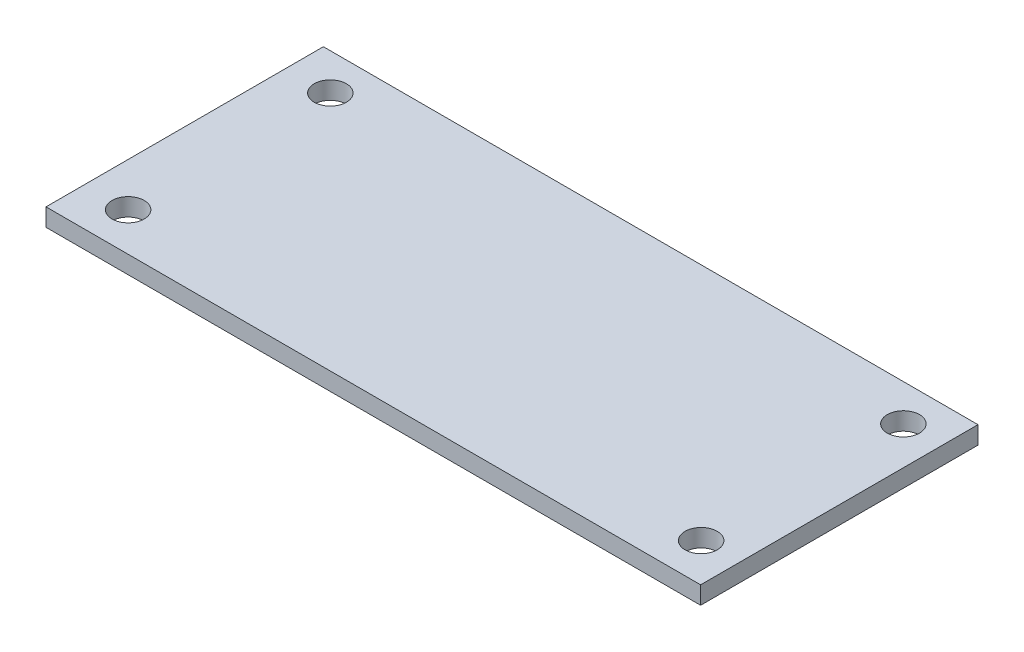
ISO-10303-21;
HEADER;
FILE_DESCRIPTION(('STEP AP214'),'2;1');
FILE_NAME('part.step','',(''),(''),'','','');
FILE_SCHEMA(('AUTOMOTIVE_DESIGN { 1 0 10303 214 1 1 1 1 }'));
ENDSEC;
DATA;
#1=APPLICATION_CONTEXT('core data for automotive mechanical design processes');
#2=APPLICATION_PROTOCOL_DEFINITION('international standard','automotive_design',2000,#1);
#3=PRODUCT_CONTEXT('',#1,'mechanical');
#4=PRODUCT('Part','Part','',(#3));
#5=PRODUCT_RELATED_PRODUCT_CATEGORY('part','',(#4));
#6=PRODUCT_DEFINITION_FORMATION('','',#4);
#7=PRODUCT_DEFINITION_CONTEXT('part definition',#1,'design');
#8=PRODUCT_DEFINITION('design','',#6,#7);
#9=PRODUCT_DEFINITION_SHAPE('','',#8);
#10=(LENGTH_UNIT() NAMED_UNIT(*) SI_UNIT(.MILLI.,.METRE.));
#11=(NAMED_UNIT(*) PLANE_ANGLE_UNIT() SI_UNIT($,.RADIAN.));
#12=(NAMED_UNIT(*) SI_UNIT($,.STERADIAN.) SOLID_ANGLE_UNIT());
#13=UNCERTAINTY_MEASURE_WITH_UNIT(LENGTH_MEASURE(1.E-05),#10,'distance_accuracy_value','');
#14=(GEOMETRIC_REPRESENTATION_CONTEXT(3) GLOBAL_UNCERTAINTY_ASSIGNED_CONTEXT((#13)) GLOBAL_UNIT_ASSIGNED_CONTEXT((#10,
#11,#12)) REPRESENTATION_CONTEXT('',''));
#15=CARTESIAN_POINT('',(0.,0.,0.));
#16=DIRECTION('',(0.,0.,1.));
#17=DIRECTION('',(1.,0.,0.));
#18=AXIS2_PLACEMENT_3D('',#15,#16,#17);
#19=CARTESIAN_POINT('',(29.972,1.6256,-12.7));
#20=DIRECTION('',(-1.,0.,0.));
#21=DIRECTION('',(0.,0.,1.));
#22=AXIS2_PLACEMENT_3D('',#19,#20,#21);
#23=PLANE('',#22);
#24=DIRECTION('',(0.,0.,-1.));
#25=VECTOR('',#24,1.);
#26=CARTESIAN_POINT('',(29.972,0.,-12.7));
#27=LINE('',#26,#25);
#28=CARTESIAN_POINT('',(29.972,0.,12.7));
#29=VERTEX_POINT('',#28);
#30=CARTESIAN_POINT('',(29.972,0.,-12.7));
#31=VERTEX_POINT('',#30);
#32=EDGE_CURVE('E95',#29,#31,#27,.T.);
#33=ORIENTED_EDGE('',*,*,#32,.T.);
#34=DIRECTION('',(0.,-1.,0.));
#35=VECTOR('',#34,1.);
#36=CARTESIAN_POINT('',(29.972,1.6256,-12.7));
#37=LINE('',#36,#35);
#38=CARTESIAN_POINT('',(29.972,1.6256,-12.7));
#39=VERTEX_POINT('',#38);
#40=EDGE_CURVE('E11',#39,#31,#37,.T.);
#41=ORIENTED_EDGE('',*,*,#40,.F.);
#42=DIRECTION('',(0.,0.,-1.));
#43=VECTOR('',#42,1.);
#44=CARTESIAN_POINT('',(29.972,1.6256,-12.7));
#45=LINE('',#44,#43);
#46=CARTESIAN_POINT('',(29.972,1.6256,12.7));
#47=VERTEX_POINT('',#46);
#48=EDGE_CURVE('E83',#47,#39,#45,.T.);
#49=ORIENTED_EDGE('',*,*,#48,.F.);
#50=DIRECTION('',(0.,-1.,0.));
#51=VECTOR('',#50,1.);
#52=CARTESIAN_POINT('',(29.972,1.6256,12.7));
#53=LINE('',#52,#51);
#54=EDGE_CURVE('E91',#47,#29,#53,.T.);
#55=ORIENTED_EDGE('',*,*,#54,.T.);
#56=EDGE_LOOP('',(#33,#41,#49,#55));
#57=FACE_BOUND('',#56,.T.);
#58=ADVANCED_FACE('F32',(#57),#23,.F.);
#59=CARTESIAN_POINT('',(-29.972,1.6256,-12.7));
#60=DIRECTION('',(0.,0.,1.));
#61=DIRECTION('',(1.,0.,0.));
#62=AXIS2_PLACEMENT_3D('',#59,#60,#61);
#63=PLANE('',#62);
#64=DIRECTION('',(-1.,0.,0.));
#65=VECTOR('',#64,1.);
#66=CARTESIAN_POINT('',(-29.972,0.,-12.7));
#67=LINE('',#66,#65);
#68=CARTESIAN_POINT('',(-29.972,0.,-12.7));
#69=VERTEX_POINT('',#68);
#70=EDGE_CURVE('E87',#31,#69,#67,.T.);
#71=ORIENTED_EDGE('',*,*,#70,.T.);
#72=DIRECTION('',(0.,-1.,0.));
#73=VECTOR('',#72,1.);
#74=CARTESIAN_POINT('',(-29.972,1.6256,-12.7));
#75=LINE('',#74,#73);
#76=CARTESIAN_POINT('',(-29.972,1.6256,-12.7));
#77=VERTEX_POINT('',#76);
#78=EDGE_CURVE('E40',#77,#69,#75,.T.);
#79=ORIENTED_EDGE('',*,*,#78,.F.);
#80=DIRECTION('',(-1.,0.,0.));
#81=VECTOR('',#80,1.);
#82=CARTESIAN_POINT('',(-29.972,1.6256,-12.7));
#83=LINE('',#82,#81);
#84=EDGE_CURVE('E78',#39,#77,#83,.T.);
#85=ORIENTED_EDGE('',*,*,#84,.F.);
#86=ORIENTED_EDGE('',*,*,#40,.T.);
#87=EDGE_LOOP('',(#71,#79,#85,#86));
#88=FACE_BOUND('',#87,.T.);
#89=ADVANCED_FACE('F86',(#88),#63,.F.);
#90=CARTESIAN_POINT('',(-29.972,1.6256,-12.7));
#91=DIRECTION('',(1.,0.,0.));
#92=DIRECTION('',(0.,0.,-1.));
#93=AXIS2_PLACEMENT_3D('',#90,#91,#92);
#94=PLANE('',#93);
#95=DIRECTION('',(0.,0.,1.));
#96=VECTOR('',#95,1.);
#97=CARTESIAN_POINT('',(-29.972,0.,-12.7));
#98=LINE('',#97,#96);
#99=CARTESIAN_POINT('',(-29.972,0.,12.7));
#100=VERTEX_POINT('',#99);
#101=EDGE_CURVE('E65',#69,#100,#98,.T.);
#102=ORIENTED_EDGE('',*,*,#101,.T.);
#103=DIRECTION('',(0.,-1.,0.));
#104=VECTOR('',#103,1.);
#105=CARTESIAN_POINT('',(-29.972,1.6256,12.7));
#106=LINE('',#105,#104);
#107=CARTESIAN_POINT('',(-29.972,1.6256,12.7));
#108=VERTEX_POINT('',#107);
#109=EDGE_CURVE('E88',#108,#100,#106,.T.);
#110=ORIENTED_EDGE('',*,*,#109,.F.);
#111=DIRECTION('',(0.,0.,1.));
#112=VECTOR('',#111,1.);
#113=CARTESIAN_POINT('',(-29.972,1.6256,-12.7));
#114=LINE('',#113,#112);
#115=EDGE_CURVE('E81',#77,#108,#114,.T.);
#116=ORIENTED_EDGE('',*,*,#115,.F.);
#117=ORIENTED_EDGE('',*,*,#78,.T.);
#118=EDGE_LOOP('',(#102,#110,#116,#117));
#119=FACE_BOUND('',#118,.T.);
#120=ADVANCED_FACE('F89',(#119),#94,.F.);
#121=CARTESIAN_POINT('',(-29.972,1.6256,12.7));
#122=DIRECTION('',(0.,0.,-1.));
#123=DIRECTION('',(-1.,0.,0.));
#124=AXIS2_PLACEMENT_3D('',#121,#122,#123);
#125=PLANE('',#124);
#126=DIRECTION('',(1.,0.,0.));
#127=VECTOR('',#126,1.);
#128=CARTESIAN_POINT('',(-29.972,0.,12.7));
#129=LINE('',#128,#127);
#130=EDGE_CURVE('E71',#100,#29,#129,.T.);
#131=ORIENTED_EDGE('',*,*,#130,.T.);
#132=ORIENTED_EDGE('',*,*,#54,.F.);
#133=DIRECTION('',(1.,0.,0.));
#134=VECTOR('',#133,1.);
#135=CARTESIAN_POINT('',(-29.972,1.6256,12.7));
#136=LINE('',#135,#134);
#137=EDGE_CURVE('E48',#108,#47,#136,.T.);
#138=ORIENTED_EDGE('',*,*,#137,.F.);
#139=ORIENTED_EDGE('',*,*,#109,.T.);
#140=EDGE_LOOP('',(#131,#132,#138,#139));
#141=FACE_BOUND('',#140,.T.);
#142=ADVANCED_FACE('F103',(#141),#125,.F.);
#143=CARTESIAN_POINT('',(0.,1.6256,0.));
#144=DIRECTION('',(0.,1.,0.));
#145=DIRECTION('',(0.,0.,1.));
#146=AXIS2_PLACEMENT_3D('',#143,#144,#145);
#147=PLANE('',#146);
#148=CARTESIAN_POINT('',(-25.9842,1.6256,9.1694));
#149=DIRECTION('',(0.,1.,0.));
#150=DIRECTION('',(0.,0.,1.));
#151=AXIS2_PLACEMENT_3D('',#148,#149,#150);
#152=CIRCLE('',#151,1.47319999999999);
#153=CARTESIAN_POINT('',(-25.9842,1.6256,10.6426));
#154=VERTEX_POINT('',#153);
#155=EDGE_CURVE('E126',#154,#154,#152,.T.);
#156=ORIENTED_EDGE('',*,*,#155,.F.);
#157=EDGE_LOOP('',(#156));
#158=FACE_BOUND('',#157,.T.);
#159=CARTESIAN_POINT('',(26.4922,1.6256,9.1694));
#160=DIRECTION('',(0.,1.,0.));
#161=DIRECTION('',(0.,0.,1.));
#162=AXIS2_PLACEMENT_3D('',#159,#160,#161);
#163=CIRCLE('',#162,1.47319999999999);
#164=CARTESIAN_POINT('',(26.4922,1.6256,10.6426));
#165=VERTEX_POINT('',#164);
#166=EDGE_CURVE('E120',#165,#165,#163,.T.);
#167=ORIENTED_EDGE('',*,*,#166,.F.);
#168=EDGE_LOOP('',(#167));
#169=FACE_BOUND('',#168,.T.);
#170=CARTESIAN_POINT('',(26.4922,1.6256,-9.3472));
#171=DIRECTION('',(0.,1.,0.));
#172=DIRECTION('',(0.,0.,1.));
#173=AXIS2_PLACEMENT_3D('',#170,#171,#172);
#174=CIRCLE('',#173,1.47319999999999);
#175=CARTESIAN_POINT('',(26.4922,1.6256,-7.87400000000001));
#176=VERTEX_POINT('',#175);
#177=EDGE_CURVE('E114',#176,#176,#174,.T.);
#178=ORIENTED_EDGE('',*,*,#177,.F.);
#179=EDGE_LOOP('',(#178));
#180=FACE_BOUND('',#179,.T.);
#181=CARTESIAN_POINT('',(-25.9842,1.6256,-9.3472));
#182=DIRECTION('',(0.,1.,0.));
#183=DIRECTION('',(0.,0.,1.));
#184=AXIS2_PLACEMENT_3D('',#181,#182,#183);
#185=CIRCLE('',#184,1.47319999999999);
#186=CARTESIAN_POINT('',(-25.9842,1.6256,-7.87400000000001));
#187=VERTEX_POINT('',#186);
#188=EDGE_CURVE('E98',#187,#187,#185,.T.);
#189=ORIENTED_EDGE('',*,*,#188,.F.);
#190=EDGE_LOOP('',(#189));
#191=FACE_BOUND('',#190,.T.);
#192=ORIENTED_EDGE('',*,*,#48,.T.);
#193=ORIENTED_EDGE('',*,*,#84,.T.);
#194=ORIENTED_EDGE('',*,*,#115,.T.);
#195=ORIENTED_EDGE('',*,*,#137,.T.);
#196=EDGE_LOOP('',(#192,#193,#194,#195));
#197=FACE_BOUND('',#196,.T.);
#198=ADVANCED_FACE('F79',(#158,#169,#180,#191,#197),#147,.T.);
#199=CARTESIAN_POINT('',(0.,0.,0.));
#200=DIRECTION('',(0.,1.,0.));
#201=DIRECTION('',(0.,0.,1.));
#202=AXIS2_PLACEMENT_3D('',#199,#200,#201);
#203=PLANE('',#202);
#204=CARTESIAN_POINT('',(-25.9842,0.,9.1694));
#205=DIRECTION('',(0.,-1.,0.));
#206=DIRECTION('',(0.,0.,-1.));
#207=AXIS2_PLACEMENT_3D('',#204,#205,#206);
#208=CIRCLE('',#207,1.47319999999999);
#209=CARTESIAN_POINT('',(-25.9842,0.,7.6962));
#210=VERTEX_POINT('',#209);
#211=EDGE_CURVE('E129',#210,#210,#208,.T.);
#212=ORIENTED_EDGE('',*,*,#211,.F.);
#213=EDGE_LOOP('',(#212));
#214=FACE_BOUND('',#213,.T.);
#215=CARTESIAN_POINT('',(26.4922,0.,9.1694));
#216=DIRECTION('',(0.,-1.,0.));
#217=DIRECTION('',(0.,0.,-1.));
#218=AXIS2_PLACEMENT_3D('',#215,#216,#217);
#219=CIRCLE('',#218,1.47319999999999);
#220=CARTESIAN_POINT('',(26.4922,0.,7.69620000000001));
#221=VERTEX_POINT('',#220);
#222=EDGE_CURVE('E123',#221,#221,#219,.T.);
#223=ORIENTED_EDGE('',*,*,#222,.F.);
#224=EDGE_LOOP('',(#223));
#225=FACE_BOUND('',#224,.T.);
#226=CARTESIAN_POINT('',(26.4922,0.,-9.3472));
#227=DIRECTION('',(0.,-1.,0.));
#228=DIRECTION('',(0.,0.,-1.));
#229=AXIS2_PLACEMENT_3D('',#226,#227,#228);
#230=CIRCLE('',#229,1.47319999999999);
#231=CARTESIAN_POINT('',(26.4922,0.,-10.8204));
#232=VERTEX_POINT('',#231);
#233=EDGE_CURVE('E117',#232,#232,#230,.T.);
#234=ORIENTED_EDGE('',*,*,#233,.F.);
#235=EDGE_LOOP('',(#234));
#236=FACE_BOUND('',#235,.T.);
#237=CARTESIAN_POINT('',(-25.9842,0.,-9.3472));
#238=DIRECTION('',(0.,-1.,0.));
#239=DIRECTION('',(0.,0.,-1.));
#240=AXIS2_PLACEMENT_3D('',#237,#238,#239);
#241=CIRCLE('',#240,1.47319999999999);
#242=CARTESIAN_POINT('',(-25.9842,0.,-10.8204));
#243=VERTEX_POINT('',#242);
#244=EDGE_CURVE('E111',#243,#243,#241,.T.);
#245=ORIENTED_EDGE('',*,*,#244,.F.);
#246=EDGE_LOOP('',(#245));
#247=FACE_BOUND('',#246,.T.);
#248=ORIENTED_EDGE('',*,*,#32,.F.);
#249=ORIENTED_EDGE('',*,*,#130,.F.);
#250=ORIENTED_EDGE('',*,*,#101,.F.);
#251=ORIENTED_EDGE('',*,*,#70,.F.);
#252=EDGE_LOOP('',(#248,#249,#250,#251));
#253=FACE_BOUND('',#252,.T.);
#254=ADVANCED_FACE('F106',(#214,#225,#236,#247,#253),#203,.F.);
#255=CARTESIAN_POINT('',(-25.9842,0.,-9.3472));
#256=DIRECTION('',(0.,-1.,0.));
#257=DIRECTION('',(0.,0.,-1.));
#258=AXIS2_PLACEMENT_3D('',#255,#256,#257);
#259=CYLINDRICAL_SURFACE('',#258,1.47319999999999);
#260=ORIENTED_EDGE('',*,*,#188,.T.);
#261=EDGE_LOOP('',(#260));
#262=FACE_BOUND('',#261,.T.);
#263=ORIENTED_EDGE('',*,*,#244,.T.);
#264=EDGE_LOOP('',(#263));
#265=FACE_BOUND('',#264,.T.);
#266=ADVANCED_FACE('F137',(#262,#265),#259,.F.);
#267=CARTESIAN_POINT('',(26.4922,0.,-9.3472));
#268=DIRECTION('',(0.,-1.,0.));
#269=DIRECTION('',(0.,0.,-1.));
#270=AXIS2_PLACEMENT_3D('',#267,#268,#269);
#271=CYLINDRICAL_SURFACE('',#270,1.47319999999999);
#272=ORIENTED_EDGE('',*,*,#177,.T.);
#273=EDGE_LOOP('',(#272));
#274=FACE_BOUND('',#273,.T.);
#275=ORIENTED_EDGE('',*,*,#233,.T.);
#276=EDGE_LOOP('',(#275));
#277=FACE_BOUND('',#276,.T.);
#278=ADVANCED_FACE('F146',(#274,#277),#271,.F.);
#279=CARTESIAN_POINT('',(26.4922,0.,9.1694));
#280=DIRECTION('',(0.,-1.,0.));
#281=DIRECTION('',(0.,0.,-1.));
#282=AXIS2_PLACEMENT_3D('',#279,#280,#281);
#283=CYLINDRICAL_SURFACE('',#282,1.47319999999999);
#284=ORIENTED_EDGE('',*,*,#166,.T.);
#285=EDGE_LOOP('',(#284));
#286=FACE_BOUND('',#285,.T.);
#287=ORIENTED_EDGE('',*,*,#222,.T.);
#288=EDGE_LOOP('',(#287));
#289=FACE_BOUND('',#288,.T.);
#290=ADVANCED_FACE('F152',(#286,#289),#283,.F.);
#291=CARTESIAN_POINT('',(-25.9842,0.,9.1694));
#292=DIRECTION('',(0.,-1.,0.));
#293=DIRECTION('',(0.,0.,-1.));
#294=AXIS2_PLACEMENT_3D('',#291,#292,#293);
#295=CYLINDRICAL_SURFACE('',#294,1.47319999999999);
#296=ORIENTED_EDGE('',*,*,#155,.T.);
#297=EDGE_LOOP('',(#296));
#298=FACE_BOUND('',#297,.T.);
#299=ORIENTED_EDGE('',*,*,#211,.T.);
#300=EDGE_LOOP('',(#299));
#301=FACE_BOUND('',#300,.T.);
#302=ADVANCED_FACE('F133',(#298,#301),#295,.F.);
#303=CLOSED_SHELL('',(#58,#89,#120,#142,#198,#254,#266,#278,#290,#302));
#304=MANIFOLD_SOLID_BREP('B2',#303);
#305=ADVANCED_BREP_SHAPE_REPRESENTATION('',(#18,#304),#14);
#306=SHAPE_DEFINITION_REPRESENTATION(#9,#305);
ENDSEC;
END-ISO-10303-21;
